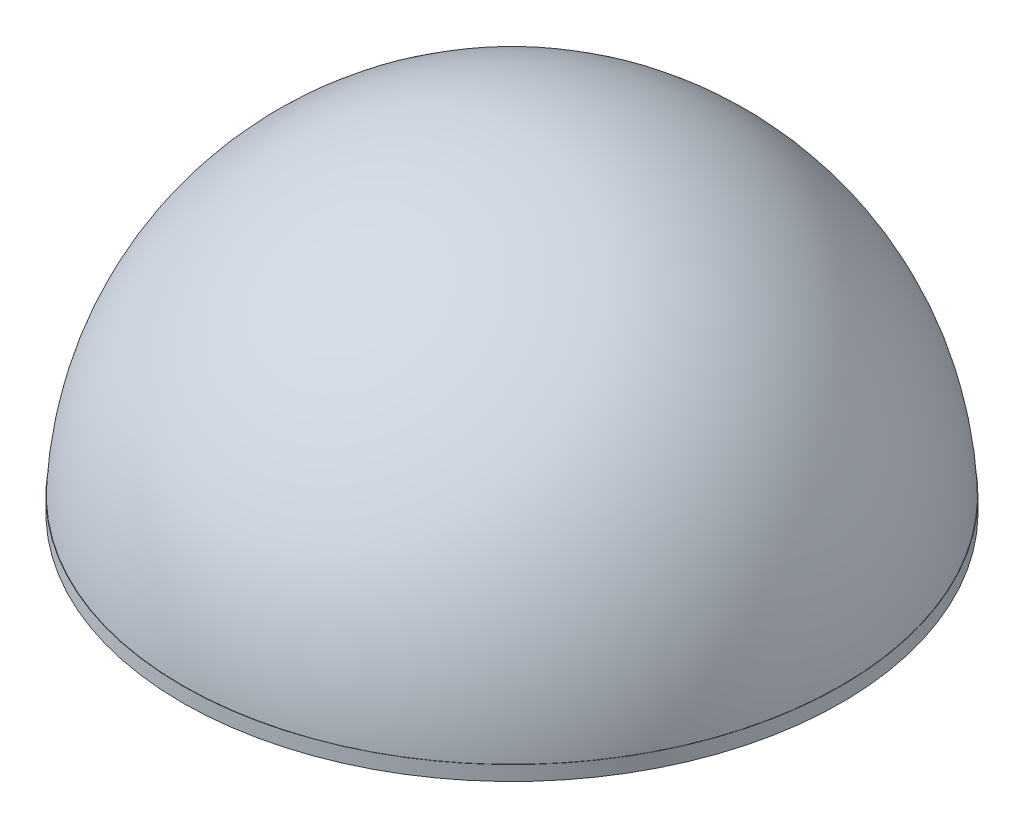
ISO-10303-21;
HEADER;
FILE_DESCRIPTION(('STEP AP214'),'2;1');
FILE_NAME('part.step','',(''),(''),'','','');
FILE_SCHEMA(('AUTOMOTIVE_DESIGN { 1 0 10303 214 1 1 1 1 }'));
ENDSEC;
DATA;
#1=APPLICATION_CONTEXT('core data for automotive mechanical design processes');
#2=APPLICATION_PROTOCOL_DEFINITION('international standard','automotive_design',2000,#1);
#3=PRODUCT_CONTEXT('',#1,'mechanical');
#4=PRODUCT('Part','Part','',(#3));
#5=PRODUCT_RELATED_PRODUCT_CATEGORY('part','',(#4));
#6=PRODUCT_DEFINITION_FORMATION('','',#4);
#7=PRODUCT_DEFINITION_CONTEXT('part definition',#1,'design');
#8=PRODUCT_DEFINITION('design','',#6,#7);
#9=PRODUCT_DEFINITION_SHAPE('','',#8);
#10=(LENGTH_UNIT() NAMED_UNIT(*) SI_UNIT(.MILLI.,.METRE.));
#11=(NAMED_UNIT(*) PLANE_ANGLE_UNIT() SI_UNIT($,.RADIAN.));
#12=(NAMED_UNIT(*) SI_UNIT($,.STERADIAN.) SOLID_ANGLE_UNIT());
#13=UNCERTAINTY_MEASURE_WITH_UNIT(LENGTH_MEASURE(1.E-05),#10,'distance_accuracy_value','');
#14=(GEOMETRIC_REPRESENTATION_CONTEXT(3) GLOBAL_UNCERTAINTY_ASSIGNED_CONTEXT((#13)) GLOBAL_UNIT_ASSIGNED_CONTEXT((#10,
#11,#12)) REPRESENTATION_CONTEXT('',''));
#15=CARTESIAN_POINT('',(0.,0.,0.));
#16=DIRECTION('',(0.,0.,1.));
#17=DIRECTION('',(1.,0.,0.));
#18=AXIS2_PLACEMENT_3D('',#15,#16,#17);
#19=CARTESIAN_POINT('',(0.,0.,0.));
#20=DIRECTION('',(0.,1.,0.));
#21=DIRECTION('',(1.,0.,0.));
#22=AXIS2_PLACEMENT_3D('',#19,#20,#21);
#23=SPHERICAL_SURFACE('',#22,45.);
#24=CARTESIAN_POINT('',(0.,2.,0.));
#25=DIRECTION('',(0.,1.,0.));
#26=DIRECTION('',(0.,0.,1.));
#27=AXIS2_PLACEMENT_3D('',#24,#25,#26);
#28=CIRCLE('',#27,44.9555335859781);
#29=CARTESIAN_POINT('',(0.,2.,44.9555335859781));
#30=VERTEX_POINT('',#29);
#31=EDGE_CURVE('E48',#30,#30,#28,.T.);
#32=ORIENTED_EDGE('',*,*,#31,.T.);
#33=EDGE_LOOP('',(#32));
#34=FACE_BOUND('',#33,.T.);
#35=ADVANCED_FACE('F32',(#34),#23,.T.);
#36=CARTESIAN_POINT('',(0.,2.,0.));
#37=DIRECTION('',(0.,-1.,0.));
#38=DIRECTION('',(0.,0.,-1.));
#39=AXIS2_PLACEMENT_3D('',#36,#37,#38);
#40=CYLINDRICAL_SURFACE('',#39,45.);
#41=CARTESIAN_POINT('',(0.,2.,0.));
#42=DIRECTION('',(0.,1.,0.));
#43=DIRECTION('',(0.,0.,1.));
#44=AXIS2_PLACEMENT_3D('',#41,#42,#43);
#45=CIRCLE('',#44,45.);
#46=CARTESIAN_POINT('',(0.,2.,45.));
#47=VERTEX_POINT('',#46);
#48=EDGE_CURVE('E53',#47,#47,#45,.T.);
#49=ORIENTED_EDGE('',*,*,#48,.F.);
#50=EDGE_LOOP('',(#49));
#51=FACE_BOUND('',#50,.T.);
#52=CARTESIAN_POINT('',(0.,0.,0.));
#53=DIRECTION('',(0.,1.,0.));
#54=DIRECTION('',(0.,0.,1.));
#55=AXIS2_PLACEMENT_3D('',#52,#53,#54);
#56=CIRCLE('',#55,45.);
#57=CARTESIAN_POINT('',(0.,0.,45.));
#58=VERTEX_POINT('',#57);
#59=EDGE_CURVE('E44',#58,#58,#56,.T.);
#60=ORIENTED_EDGE('',*,*,#59,.T.);
#61=EDGE_LOOP('',(#60));
#62=FACE_BOUND('',#61,.T.);
#63=ADVANCED_FACE('F91',(#51,#62),#40,.T.);
#64=CARTESIAN_POINT('',(0.,2.,0.));
#65=DIRECTION('',(0.,1.,0.));
#66=DIRECTION('',(0.,0.,1.));
#67=AXIS2_PLACEMENT_3D('',#64,#65,#66);
#68=PLANE('',#67);
#69=ORIENTED_EDGE('',*,*,#31,.F.);
#70=EDGE_LOOP('',(#69));
#71=FACE_BOUND('',#70,.T.);
#72=ORIENTED_EDGE('',*,*,#48,.T.);
#73=EDGE_LOOP('',(#72));
#74=FACE_BOUND('',#73,.T.);
#75=ADVANCED_FACE('F82',(#71,#74),#68,.T.);
#76=CARTESIAN_POINT('',(0.,0.,0.));
#77=DIRECTION('',(0.,1.,0.));
#78=DIRECTION('',(0.,0.,1.));
#79=AXIS2_PLACEMENT_3D('',#76,#77,#78);
#80=PLANE('',#79);
#81=ORIENTED_EDGE('',*,*,#59,.F.);
#82=EDGE_LOOP('',(#81));
#83=FACE_BOUND('',#82,.T.);
#84=ADVANCED_FACE('F34',(#83),#80,.F.);
#85=CLOSED_SHELL('',(#35,#63,#75,#84));
#86=CARTESIAN_POINT('',(0.,2.,0.));
#87=DIRECTION('',(0.,1.,0.));
#88=DIRECTION('',(0.,0.,1.));
#89=AXIS2_PLACEMENT_3D('',#86,#87,#88);
#90=CIRCLE('',#89,10.);
#91=CARTESIAN_POINT('',(0.,2.,10.));
#92=VERTEX_POINT('',#91);
#93=EDGE_CURVE('E10',#92,#92,#90,.T.);
#94=ORIENTED_EDGE('',*,*,#93,.F.);
#95=EDGE_LOOP('',(#94));
#96=FACE_BOUND('',#95,.T.);
#97=CARTESIAN_POINT('',(0.,2.,0.));
#98=DIRECTION('',(0.,1.,0.));
#99=DIRECTION('',(0.,0.,1.));
#100=AXIS2_PLACEMENT_3D('',#97,#98,#99);
#101=CIRCLE('',#100,42.9534631898291);
#102=CARTESIAN_POINT('',(0.,2.,42.9534631898291));
#103=VERTEX_POINT('',#102);
#104=EDGE_CURVE('E40',#103,#103,#101,.T.);
#105=ORIENTED_EDGE('',*,*,#104,.T.);
#106=EDGE_LOOP('',(#105));
#107=FACE_BOUND('',#106,.T.);
#108=ADVANCED_FACE('F76',(#96,#107),#68,.T.);
#109=CARTESIAN_POINT('',(0.,0.,0.));
#110=DIRECTION('',(0.,1.,0.));
#111=DIRECTION('',(1.,0.,0.));
#112=AXIS2_PLACEMENT_3D('',#109,#110,#111);
#113=SPHERICAL_SURFACE('',#112,43.);
#114=ORIENTED_EDGE('',*,*,#104,.F.);
#115=EDGE_LOOP('',(#114));
#116=FACE_BOUND('',#115,.T.);
#117=ADVANCED_FACE('F80',(#116),#113,.F.);
#118=CARTESIAN_POINT('',(-10.,30.,0.));
#119=DIRECTION('',(0.,1.,0.));
#120=DIRECTION('',(0.,0.,1.));
#121=AXIS2_PLACEMENT_3D('',#118,#119,#120);
#122=PLANE('',#121);
#123=CARTESIAN_POINT('',(0.,30.,0.));
#124=DIRECTION('',(0.,1.,0.));
#125=DIRECTION('',(0.,0.,1.));
#126=AXIS2_PLACEMENT_3D('',#123,#124,#125);
#127=CIRCLE('',#126,9.);
#128=CARTESIAN_POINT('',(0.,30.,9.));
#129=VERTEX_POINT('',#128);
#130=EDGE_CURVE('E59',#129,#129,#127,.T.);
#131=ORIENTED_EDGE('',*,*,#130,.T.);
#132=EDGE_LOOP('',(#131));
#133=FACE_BOUND('',#132,.T.);
#134=ADVANCED_FACE('F63',(#133),#122,.T.);
#135=CARTESIAN_POINT('',(0.,30.,0.));
#136=DIRECTION('',(0.,1.,0.));
#137=DIRECTION('',(0.,0.,1.));
#138=AXIS2_PLACEMENT_3D('',#135,#136,#137);
#139=CYLINDRICAL_SURFACE('',#138,10.);
#140=ORIENTED_EDGE('',*,*,#93,.T.);
#141=EDGE_LOOP('',(#140));
#142=FACE_BOUND('',#141,.T.);
#143=CARTESIAN_POINT('',(0.,29.,0.));
#144=DIRECTION('',(0.,1.,0.));
#145=DIRECTION('',(0.,0.,1.));
#146=AXIS2_PLACEMENT_3D('',#143,#144,#145);
#147=CIRCLE('',#146,10.);
#148=CARTESIAN_POINT('',(0.,29.,10.));
#149=VERTEX_POINT('',#148);
#150=EDGE_CURVE('E56',#149,#149,#147,.F.);
#151=ORIENTED_EDGE('',*,*,#150,.T.);
#152=EDGE_LOOP('',(#151));
#153=FACE_BOUND('',#152,.T.);
#154=ADVANCED_FACE('F67',(#142,#153),#139,.T.);
#155=CARTESIAN_POINT('',(0.,29.,0.));
#156=DIRECTION('',(0.,1.,0.));
#157=DIRECTION('',(0.,0.,1.));
#158=AXIS2_PLACEMENT_3D('',#155,#156,#157);
#159=TOROIDAL_SURFACE('',#158,9.,1.);
#160=ORIENTED_EDGE('',*,*,#150,.F.);
#161=EDGE_LOOP('',(#160));
#162=FACE_BOUND('',#161,.T.);
#163=ORIENTED_EDGE('',*,*,#130,.F.);
#164=EDGE_LOOP('',(#163));
#165=FACE_BOUND('',#164,.T.);
#166=ADVANCED_FACE('F65',(#162,#165),#159,.T.);
#167=CLOSED_SHELL('',(#108,#117,#134,#154,#166));
#168=ORIENTED_CLOSED_SHELL('',*,#167,.T.);
#169=BREP_WITH_VOIDS('B2',#85,(#168));
#170=ADVANCED_BREP_SHAPE_REPRESENTATION('',(#18,#169),#14);
#171=SHAPE_DEFINITION_REPRESENTATION(#9,#170);
ENDSEC;
END-ISO-10303-21;
